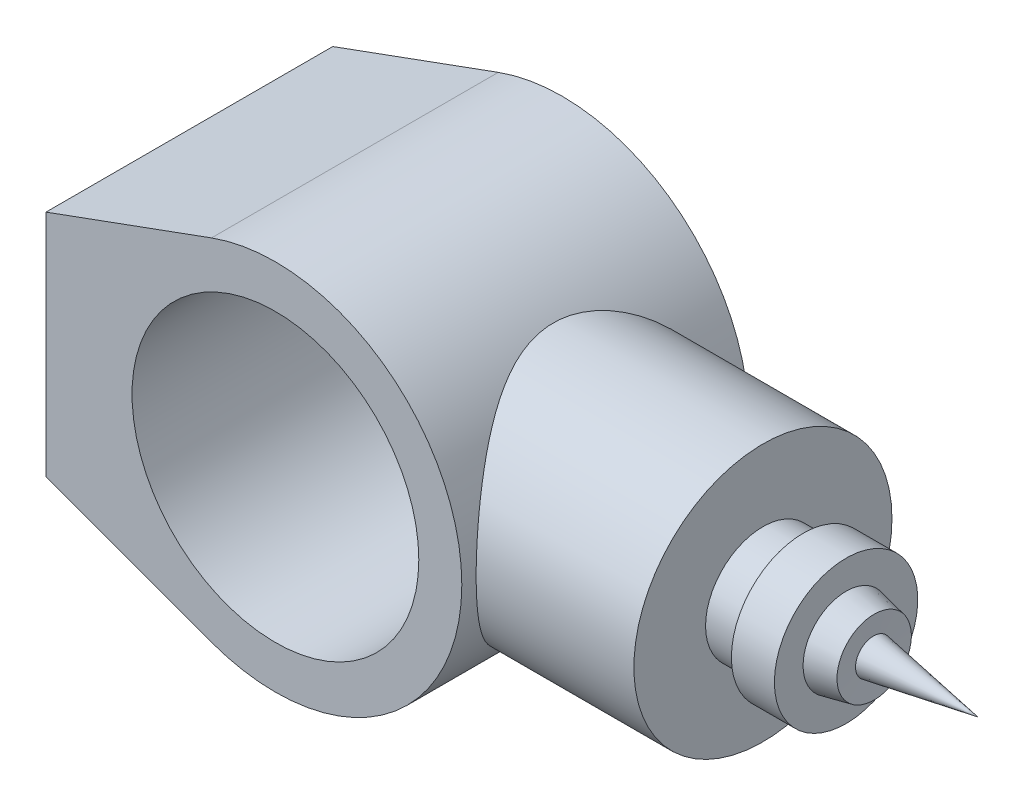
ISO-10303-21;
HEADER;
FILE_DESCRIPTION(('STEP AP214'),'2;1');
FILE_NAME('part.step','',(''),(''),'','','');
FILE_SCHEMA(('AUTOMOTIVE_DESIGN { 1 0 10303 214 1 1 1 1 }'));
ENDSEC;
DATA;
#1=APPLICATION_CONTEXT('core data for automotive mechanical design processes');
#2=APPLICATION_PROTOCOL_DEFINITION('international standard','automotive_design',2000,#1);
#3=PRODUCT_CONTEXT('',#1,'mechanical');
#4=PRODUCT('Part','Part','',(#3));
#5=PRODUCT_RELATED_PRODUCT_CATEGORY('part','',(#4));
#6=PRODUCT_DEFINITION_FORMATION('','',#4);
#7=PRODUCT_DEFINITION_CONTEXT('part definition',#1,'design');
#8=PRODUCT_DEFINITION('design','',#6,#7);
#9=PRODUCT_DEFINITION_SHAPE('','',#8);
#10=(LENGTH_UNIT() NAMED_UNIT(*) SI_UNIT(.MILLI.,.METRE.));
#11=(NAMED_UNIT(*) PLANE_ANGLE_UNIT() SI_UNIT($,.RADIAN.));
#12=(NAMED_UNIT(*) SI_UNIT($,.STERADIAN.) SOLID_ANGLE_UNIT());
#13=UNCERTAINTY_MEASURE_WITH_UNIT(LENGTH_MEASURE(1.E-05),#10,'distance_accuracy_value','');
#14=(GEOMETRIC_REPRESENTATION_CONTEXT(3) GLOBAL_UNCERTAINTY_ASSIGNED_CONTEXT((#13)) GLOBAL_UNIT_ASSIGNED_CONTEXT((#10,
#11,#12)) REPRESENTATION_CONTEXT('',''));
#15=CARTESIAN_POINT('',(0.,0.,0.));
#16=DIRECTION('',(0.,0.,1.));
#17=DIRECTION('',(1.,0.,0.));
#18=AXIS2_PLACEMENT_3D('',#15,#16,#17);
#19=CARTESIAN_POINT('',(0.,0.,50.));
#20=DIRECTION('',(0.,0.,1.));
#21=DIRECTION('',(1.,0.,0.));
#22=AXIS2_PLACEMENT_3D('',#19,#20,#21);
#23=PLANE('',#22);
#24=DIRECTION('',(-0.939410286372225,-0.342794856813887,0.));
#25=VECTOR('',#24,1.);
#26=CARTESIAN_POINT('',(-80.,40.,50.));
#27=LINE('',#26,#25);
#28=CARTESIAN_POINT('',(-22.2816656929027,61.0616686141947,50.));
#29=VERTEX_POINT('',#28);
#30=CARTESIAN_POINT('',(-80.,40.,50.));
#31=VERTEX_POINT('',#30);
#32=EDGE_CURVE('E197',#29,#31,#27,.T.);
#33=ORIENTED_EDGE('',*,*,#32,.T.);
#34=DIRECTION('',(0.,-1.,0.));
#35=VECTOR('',#34,1.);
#36=CARTESIAN_POINT('',(-80.,40.,50.));
#37=LINE('',#36,#35);
#38=CARTESIAN_POINT('',(-80.,-40.,50.));
#39=VERTEX_POINT('',#38);
#40=EDGE_CURVE('E88',#31,#39,#37,.T.);
#41=ORIENTED_EDGE('',*,*,#40,.T.);
#42=DIRECTION('',(0.939410286372225,-0.342794856813887,0.));
#43=VECTOR('',#42,1.);
#44=CARTESIAN_POINT('',(-80.,-40.,50.));
#45=LINE('',#44,#43);
#46=CARTESIAN_POINT('',(-22.2816656929027,-61.0616686141947,50.));
#47=VERTEX_POINT('',#46);
#48=EDGE_CURVE('E190',#39,#47,#45,.T.);
#49=ORIENTED_EDGE('',*,*,#48,.T.);
#50=CARTESIAN_POINT('',(0.,0.,50.));
#51=DIRECTION('',(0.,0.,1.));
#52=DIRECTION('',(1.,0.,0.));
#53=AXIS2_PLACEMENT_3D('',#50,#51,#52);
#54=CIRCLE('',#53,65.);
#55=EDGE_CURVE('E57',#47,#29,#54,.T.);
#56=ORIENTED_EDGE('',*,*,#55,.T.);
#57=EDGE_LOOP('',(#33,#41,#49,#56));
#58=FACE_BOUND('',#57,.T.);
#59=CARTESIAN_POINT('',(0.,0.,50.));
#60=DIRECTION('',(0.,0.,1.));
#61=DIRECTION('',(1.,0.,0.));
#62=AXIS2_PLACEMENT_3D('',#59,#60,#61);
#63=CIRCLE('',#62,50.);
#64=CARTESIAN_POINT('',(50.,0.,50.));
#65=VERTEX_POINT('',#64);
#66=EDGE_CURVE('E212',#65,#65,#63,.T.);
#67=ORIENTED_EDGE('',*,*,#66,.F.);
#68=EDGE_LOOP('',(#67));
#69=FACE_BOUND('',#68,.T.);
#70=ADVANCED_FACE('F39',(#58,#69),#23,.T.);
#71=CARTESIAN_POINT('',(0.,0.,-50.));
#72=DIRECTION('',(0.,0.,1.));
#73=DIRECTION('',(1.,0.,0.));
#74=AXIS2_PLACEMENT_3D('',#71,#72,#73);
#75=PLANE('',#74);
#76=DIRECTION('',(-0.939410286372225,-0.342794856813887,0.));
#77=VECTOR('',#76,1.);
#78=CARTESIAN_POINT('',(-80.,40.,-50.));
#79=LINE('',#78,#77);
#80=CARTESIAN_POINT('',(-22.2816656929027,61.0616686141947,-50.));
#81=VERTEX_POINT('',#80);
#82=CARTESIAN_POINT('',(-80.,40.,-50.));
#83=VERTEX_POINT('',#82);
#84=EDGE_CURVE('E188',#81,#83,#79,.T.);
#85=ORIENTED_EDGE('',*,*,#84,.F.);
#86=CARTESIAN_POINT('',(0.,0.,-50.));
#87=DIRECTION('',(0.,0.,1.));
#88=DIRECTION('',(1.,0.,0.));
#89=AXIS2_PLACEMENT_3D('',#86,#87,#88);
#90=CIRCLE('',#89,65.);
#91=CARTESIAN_POINT('',(-22.2816656929027,-61.0616686141947,-50.));
#92=VERTEX_POINT('',#91);
#93=EDGE_CURVE('E81',#92,#81,#90,.T.);
#94=ORIENTED_EDGE('',*,*,#93,.F.);
#95=DIRECTION('',(0.939410286372225,-0.342794856813887,0.));
#96=VECTOR('',#95,1.);
#97=CARTESIAN_POINT('',(-80.,-40.,-50.));
#98=LINE('',#97,#96);
#99=CARTESIAN_POINT('',(-80.,-40.,-50.));
#100=VERTEX_POINT('',#99);
#101=EDGE_CURVE('E75',#100,#92,#98,.T.);
#102=ORIENTED_EDGE('',*,*,#101,.F.);
#103=DIRECTION('',(0.,-1.,0.));
#104=VECTOR('',#103,1.);
#105=CARTESIAN_POINT('',(-80.,40.,-50.));
#106=LINE('',#105,#104);
#107=EDGE_CURVE('E182',#83,#100,#106,.T.);
#108=ORIENTED_EDGE('',*,*,#107,.F.);
#109=EDGE_LOOP('',(#85,#94,#102,#108));
#110=FACE_BOUND('',#109,.T.);
#111=CARTESIAN_POINT('',(0.,0.,-50.));
#112=DIRECTION('',(0.,0.,1.));
#113=DIRECTION('',(1.,0.,0.));
#114=AXIS2_PLACEMENT_3D('',#111,#112,#113);
#115=CIRCLE('',#114,50.);
#116=CARTESIAN_POINT('',(50.,0.,-50.));
#117=VERTEX_POINT('',#116);
#118=EDGE_CURVE('E215',#117,#117,#115,.T.);
#119=ORIENTED_EDGE('',*,*,#118,.T.);
#120=EDGE_LOOP('',(#119));
#121=FACE_BOUND('',#120,.T.);
#122=ADVANCED_FACE('F162',(#110,#121),#75,.F.);
#123=CARTESIAN_POINT('',(-80.,40.,50.));
#124=DIRECTION('',(0.342794856813887,-0.939410286372225,0.));
#125=DIRECTION('',(0.939410286372225,0.342794856813887,0.));
#126=AXIS2_PLACEMENT_3D('',#123,#124,#125);
#127=PLANE('',#126);
#128=ORIENTED_EDGE('',*,*,#84,.T.);
#129=DIRECTION('',(0.,0.,-1.));
#130=VECTOR('',#129,1.);
#131=CARTESIAN_POINT('',(-80.,40.,50.));
#132=LINE('',#131,#130);
#133=EDGE_CURVE('E11',#31,#83,#132,.T.);
#134=ORIENTED_EDGE('',*,*,#133,.F.);
#135=ORIENTED_EDGE('',*,*,#32,.F.);
#136=DIRECTION('',(0.,0.,-1.));
#137=VECTOR('',#136,1.);
#138=CARTESIAN_POINT('',(-22.2816656929027,61.0616686141947,50.));
#139=LINE('',#138,#137);
#140=EDGE_CURVE('E201',#29,#81,#139,.T.);
#141=ORIENTED_EDGE('',*,*,#140,.T.);
#142=EDGE_LOOP('',(#128,#134,#135,#141));
#143=FACE_BOUND('',#142,.T.);
#144=ADVANCED_FACE('F41',(#143),#127,.F.);
#145=CARTESIAN_POINT('',(-80.,40.,50.));
#146=DIRECTION('',(1.,0.,0.));
#147=DIRECTION('',(0.,1.,0.));
#148=AXIS2_PLACEMENT_3D('',#145,#146,#147);
#149=PLANE('',#148);
#150=ORIENTED_EDGE('',*,*,#107,.T.);
#151=DIRECTION('',(0.,0.,-1.));
#152=VECTOR('',#151,1.);
#153=CARTESIAN_POINT('',(-80.,-40.,50.));
#154=LINE('',#153,#152);
#155=EDGE_CURVE('E49',#39,#100,#154,.T.);
#156=ORIENTED_EDGE('',*,*,#155,.F.);
#157=ORIENTED_EDGE('',*,*,#40,.F.);
#158=ORIENTED_EDGE('',*,*,#133,.T.);
#159=EDGE_LOOP('',(#150,#156,#157,#158));
#160=FACE_BOUND('',#159,.T.);
#161=ADVANCED_FACE('F176',(#160),#149,.F.);
#162=CARTESIAN_POINT('',(-80.,-40.,50.));
#163=DIRECTION('',(0.342794856813887,0.939410286372225,0.));
#164=DIRECTION('',(-0.939410286372225,0.342794856813887,0.));
#165=AXIS2_PLACEMENT_3D('',#162,#163,#164);
#166=PLANE('',#165);
#167=ORIENTED_EDGE('',*,*,#101,.T.);
#168=DIRECTION('',(0.,0.,-1.));
#169=VECTOR('',#168,1.);
#170=CARTESIAN_POINT('',(-22.2816656929027,-61.0616686141947,50.));
#171=LINE('',#170,#169);
#172=EDGE_CURVE('E192',#47,#92,#171,.T.);
#173=ORIENTED_EDGE('',*,*,#172,.F.);
#174=ORIENTED_EDGE('',*,*,#48,.F.);
#175=ORIENTED_EDGE('',*,*,#155,.T.);
#176=EDGE_LOOP('',(#167,#173,#174,#175));
#177=FACE_BOUND('',#176,.T.);
#178=ADVANCED_FACE('F173',(#177),#166,.F.);
#179=CARTESIAN_POINT('',(0.,0.,50.));
#180=DIRECTION('',(0.,0.,-1.));
#181=DIRECTION('',(-1.,0.,0.));
#182=AXIS2_PLACEMENT_3D('',#179,#180,#181);
#183=CYLINDRICAL_SURFACE('',#182,65.);
#184=CARTESIAN_POINT('',(65.,0.,-45.));
#185=CARTESIAN_POINT('',(65.0000011696056,1.12147330120565,-45.0000012025283));
#186=CARTESIAN_POINT('',(64.9709159765212,2.24292945230778,-44.9580201602482));
#187=CARTESIAN_POINT('',(64.8553068641383,4.47658414079083,-44.790785609369));
#188=CARTESIAN_POINT('',(64.7687842573088,5.58878288911932,-44.6655340035371));
#189=CARTESIAN_POINT('',(64.5403785763001,7.79555151848628,-44.3336771879691));
#190=CARTESIAN_POINT('',(64.3984760503456,8.89011506447751,-44.1270433931238));
#191=CARTESIAN_POINT('',(64.0626457436966,11.0533096019768,-43.6354760134034));
#192=CARTESIAN_POINT('',(63.8687169569864,12.1219400915896,-43.3505409144375));
#193=CARTESIAN_POINT('',(63.4342222744662,14.2212125160505,-42.7078017297046));
#194=CARTESIAN_POINT('',(63.1938918545645,15.2520162370063,-42.3503651251477));
#195=CARTESIAN_POINT('',(62.6709259446924,17.2756280115286,-41.5659763086892));
#196=CARTESIAN_POINT('',(62.3882907364915,18.268436318107,-41.1390245597888));
#197=CARTESIAN_POINT('',(61.786108553932,20.2116697228795,-40.2199419970838));
#198=CARTESIAN_POINT('',(61.4665619062631,21.1620951960855,-39.7278117601444));
#199=CARTESIAN_POINT('',(60.7962171584065,23.0172309124315,-38.6825647509799));
#200=CARTESIAN_POINT('',(60.4454175300334,23.9219389167185,-38.1294449962195));
#201=CARTESIAN_POINT('',(59.6865648974474,25.7601880140228,-36.9151737617935));
#202=CARTESIAN_POINT('',(59.27618815402,26.6893215363404,-36.2488040005491));
#203=CARTESIAN_POINT('',(58.4330275057249,28.4880338622967,-34.8529502059224));
#204=CARTESIAN_POINT('',(58.0002425478181,29.3576098626539,-34.1234632053608));
#205=CARTESIAN_POINT('',(57.1195111836477,31.0364486388513,-32.6040251352403));
#206=CARTESIAN_POINT('',(56.6715447181891,31.8456267033451,-31.8139921794123));
#207=CARTESIAN_POINT('',(55.7691986061138,33.4006700551814,-30.1773036556993));
#208=CARTESIAN_POINT('',(55.3148185876119,34.1465316534289,-29.3306447936721));
#209=CARTESIAN_POINT('',(54.3303114345595,35.6959084068904,-27.4326466159467));
#210=CARTESIAN_POINT('',(53.8005937511269,36.4872853280241,-26.3711450656526));
#211=CARTESIAN_POINT('',(52.7593327891933,37.9773509509911,-24.17604025639));
#212=CARTESIAN_POINT('',(52.2477941160227,38.6760162868262,-23.0424189272517));
#213=CARTESIAN_POINT('',(51.2608149265043,39.9749077721744,-20.7072341856928));
#214=CARTESIAN_POINT('',(50.7853275075273,40.5752630453964,-19.5057627267966));
#215=CARTESIAN_POINT('',(49.8892399163793,41.6721166930025,-17.036931864064));
#216=CARTESIAN_POINT('',(49.4686114171659,42.1686687478853,-15.7696069409943));
#217=CARTESIAN_POINT('',(48.8208029416879,42.9149535309565,-13.5723996352816));
#218=CARTESIAN_POINT('',(48.5738420263557,43.1936925213245,-12.6581208440976));
#219=CARTESIAN_POINT('',(48.1238801744123,43.6944569649788,-10.803538922355));
#220=CARTESIAN_POINT('',(47.9208721021929,43.9164916250901,-9.86324004407418));
#221=CARTESIAN_POINT('',(47.5660754926548,44.3005296261305,-7.96250438663408));
#222=CARTESIAN_POINT('',(47.4142038087044,44.4626304606427,-7.00210302149486));
#223=CARTESIAN_POINT('',(47.1671263845177,44.7246555122386,-5.06554052628516));
#224=CARTESIAN_POINT('',(47.0719206259529,44.824579749433,-4.08937940131223));
#225=CARTESIAN_POINT('',(46.9418899090943,44.9607388198673,-2.1232364847967));
#226=CARTESIAN_POINT('',(46.9073939345417,44.9966266570423,-1.13320851844658));
#227=CARTESIAN_POINT('',(46.9013571135476,45.0029190462422,0.847248377093849));
#228=CARTESIAN_POINT('',(46.9298161498631,44.9733237202183,1.837677305534));
#229=CARTESIAN_POINT('',(47.0484302849821,44.8492190899201,3.81128752429081));
#230=CARTESIAN_POINT('',(47.13862305521,44.7546701492421,4.79446401850661));
#231=CARTESIAN_POINT('',(47.3768313176079,44.5024241630868,6.74551496467455));
#232=CARTESIAN_POINT('',(47.5248480621437,44.3447257499009,7.71338908473168));
#233=CARTESIAN_POINT('',(47.862176427184,43.9803320764262,9.56919366964684));
#234=CARTESIAN_POINT('',(48.0484149088864,43.7772163066585,10.4583970625519));
#235=CARTESIAN_POINT('',(48.4609441046406,43.32010640119,12.2144143492181));
#236=CARTESIAN_POINT('',(48.6872496045115,43.0660934784815,13.0812198417583));
#237=CARTESIAN_POINT('',(49.1738509640383,42.5096331932465,14.7898225666927));
#238=CARTESIAN_POINT('',(49.4341648638834,42.2071601049958,15.6316062329481));
#239=CARTESIAN_POINT('',(49.9825182796335,41.5563350032134,17.2876417419013));
#240=CARTESIAN_POINT('',(50.2705534011697,41.2079902580444,18.1018979206949));
#241=CARTESIAN_POINT('',(51.0225431471344,40.2767822129268,20.1137766396802));
#242=CARTESIAN_POINT('',(51.5007434523328,39.6654891440572,21.2930273345177));
#243=CARTESIAN_POINT('',(52.4891158781477,38.348029920852,23.5833678403921));
#244=CARTESIAN_POINT('',(52.9993005340588,37.6418264436727,24.6944305853524));
#245=CARTESIAN_POINT('',(54.0361557973494,36.1376496350166,26.8476775780095));
#246=CARTESIAN_POINT('',(54.5628535785461,35.3395185623559,27.8897384505711));
#247=CARTESIAN_POINT('',(55.6171804467178,33.6558443419671,29.8998791095632));
#248=CARTESIAN_POINT('',(56.1448094104418,32.7703120184234,30.8679680307498));
#249=CARTESIAN_POINT('',(57.1932449701135,30.9045304086319,32.7363921475659));
#250=CARTESIAN_POINT('',(57.7139191350983,29.9233731295192,33.6358963165067));
#251=CARTESIAN_POINT('',(58.7296419536465,27.8771206485979,35.350355349792));
#252=CARTESIAN_POINT('',(59.2246882700661,26.8120178135979,36.1653025097018));
#253=CARTESIAN_POINT('',(60.1756566955639,24.6035209522421,37.7024332048813));
#254=CARTESIAN_POINT('',(60.6316475651595,23.4602711709794,38.4247809320632));
#255=CARTESIAN_POINT('',(61.4931891608211,21.0989507187335,39.7703323765769));
#256=CARTESIAN_POINT('',(61.898755017873,19.8809026570889,40.3935658507715));
#257=CARTESIAN_POINT('',(62.5646802947783,17.6549035875763,41.4059204565395));
#258=CARTESIAN_POINT('',(62.8372982548467,16.6602403417734,41.8163120535009));
#259=CARTESIAN_POINT('',(63.3397164077328,14.6345031625144,42.5675669112335));
#260=CARTESIAN_POINT('',(63.569522535998,13.603434299959,42.9084398107234));
#261=CARTESIAN_POINT('',(63.9815049902596,11.5110112910016,43.5164676119118));
#262=CARTESIAN_POINT('',(64.1637052650743,10.4496726714621,43.7836595836378));
#263=CARTESIAN_POINT('',(64.476639865795,8.30296993183372,44.2409869387356));
#264=CARTESIAN_POINT('',(64.6073730982257,7.21760530180254,44.431120684921));
#265=CARTESIAN_POINT('',(64.8147345736682,5.02649787175022,44.7321113931983));
#266=CARTESIAN_POINT('',(64.8911534961694,3.92069290489762,44.8426616714377));
#267=CARTESIAN_POINT('',(64.9872183357685,1.70145350776207,44.981563734156));
#268=CARTESIAN_POINT('',(65.0068642771874,0.58801908074768,45.0099155538474));
#269=CARTESIAN_POINT('',(64.9889001241945,-1.63741781931567,44.9839662509349));
#270=CARTESIAN_POINT('',(64.9512898349751,-2.74942028747967,44.929664847113));
#271=CARTESIAN_POINT('',(64.819734418053,-4.96298947367603,44.7392747901952));
#272=CARTESIAN_POINT('',(64.7257910494465,-6.06455651648128,44.6031886909653));
#273=CARTESIAN_POINT('',(64.491175703309,-8.18254449212149,44.2620157992034));
#274=CARTESIAN_POINT('',(64.3536808680178,-9.20007959997774,44.0616107864454));
#275=CARTESIAN_POINT('',(64.0337856060908,-11.2121337136589,43.5930613516679));
#276=CARTESIAN_POINT('',(63.8513873855499,-12.2066538475799,43.3249202574929));
#277=CARTESIAN_POINT('',(63.4451725249075,-14.1673074608523,42.7239854011605));
#278=CARTESIAN_POINT('',(63.2213525684632,-15.1334386601223,42.3911864622047));
#279=CARTESIAN_POINT('',(62.736336352677,-17.0327019487273,41.6643868113868));
#280=CARTESIAN_POINT('',(62.4751380044848,-17.965832190203,41.2703826790343));
#281=CARTESIAN_POINT('',(61.8990085085122,-19.8637431772395,40.3931275129008));
#282=CARTESIAN_POINT('',(61.58152095285,-20.8256806929253,39.9054081529014));
#283=CARTESIAN_POINT('',(60.9142086391395,-22.7035764997345,38.8677076181211));
#284=CARTESIAN_POINT('',(60.5643826081083,-23.6195329786528,38.3177239921568));
#285=CARTESIAN_POINT('',(59.8381347129401,-25.4032558353403,37.1592008079418));
#286=CARTESIAN_POINT('',(59.4616987975441,-26.270996314329,36.5506302507532));
#287=CARTESIAN_POINT('',(58.6884577670336,-27.9557544991496,35.2787474176624));
#288=CARTESIAN_POINT('',(58.2916515549571,-28.7727694681138,34.6154321925309));
#289=CARTESIAN_POINT('',(57.4151711853793,-30.4889708749912,33.1199200847161));
#290=CARTESIAN_POINT('',(56.9328754552547,-31.3785212006928,32.2781812569548));
#291=CARTESIAN_POINT('',(55.9590893109094,-33.083904221517,30.5278352445589));
#292=CARTESIAN_POINT('',(55.4675975421249,-33.8997259516808,29.6192181500899));
#293=CARTESIAN_POINT('',(54.4860350387396,-35.45586994741,27.7375714933992));
#294=CARTESIAN_POINT('',(53.9959654596117,-36.1961418986444,26.7644997080006));
#295=CARTESIAN_POINT('',(53.0294834997435,-37.5978502361012,24.7568233036381));
#296=CARTESIAN_POINT('',(52.553069328415,-38.2592969946585,23.7222268074148));
#297=CARTESIAN_POINT('',(51.679941347726,-39.4291013564639,21.7149007388746));
#298=CARTESIAN_POINT('',(51.2803372484816,-39.9463152685163,20.7485884228094));
#299=CARTESIAN_POINT('',(50.5123974548912,-40.913063666173,18.7705314851885));
#300=CARTESIAN_POINT('',(50.1440619804653,-41.3625976757848,17.7587865441704));
#301=CARTESIAN_POINT('',(49.4504928922364,-42.1893301292689,15.693797265063));
#302=CARTESIAN_POINT('',(49.1251906412472,-42.566644202947,14.6406225749502));
#303=CARTESIAN_POINT('',(48.5290098021012,-43.2451098617227,12.4950157035289));
#304=CARTESIAN_POINT('',(48.2581179989952,-43.5462799449171,11.4025931307277));
#305=CARTESIAN_POINT('',(47.8271610412375,-44.0186874861181,9.39216299943509));
#306=CARTESIAN_POINT('',(47.6558419905218,-44.2036946073207,8.47979353570418));
#307=CARTESIAN_POINT('',(47.3627606953031,-44.517583244497,6.63757582668244));
#308=CARTESIAN_POINT('',(47.2409923142224,-44.6464717105955,5.70772976070373));
#309=CARTESIAN_POINT('',(47.05166615705,-44.8459556683364,3.83718735816971));
#310=CARTESIAN_POINT('',(46.9840561376509,-44.9166073394187,2.89650236820514));
#311=CARTESIAN_POINT('',(46.9055698265682,-44.9985645522097,1.01014116515035));
#312=CARTESIAN_POINT('',(46.8946943314281,-45.0098692606967,0.0644648821697862));
#313=CARTESIAN_POINT('',(46.9301408777119,-44.972908524549,-1.82506201386804));
#314=CARTESIAN_POINT('',(46.9764888551696,-44.9246160680299,-2.76891160474201));
#315=CARTESIAN_POINT('',(47.1245232303033,-44.7693052695385,-4.64731891289862));
#316=CARTESIAN_POINT('',(47.226209296244,-44.6622872796082,-5.58187668584875));
#317=CARTESIAN_POINT('',(47.4811423262629,-44.3911660407895,-7.43666598606561));
#318=CARTESIAN_POINT('',(47.634452919394,-44.2269923369625,-8.35687836049678));
#319=CARTESIAN_POINT('',(47.9871889035597,-43.8440109221367,-10.1768310643423));
#320=CARTESIAN_POINT('',(48.1866204648689,-43.6251959006593,-11.0765686368372));
#321=CARTESIAN_POINT('',(48.6908782922366,-43.0625185245671,-13.116726178063));
#322=CARTESIAN_POINT('',(49.0093972350599,-42.7008255731353,-14.2488681052183));
#323=CARTESIAN_POINT('',(49.699554494161,-41.8955268796886,-16.4668795226373));
#324=CARTESIAN_POINT('',(50.0712093704162,-41.4518955887103,-17.5527344499461));
#325=CARTESIAN_POINT('',(50.8544123719762,-40.4872212981013,-19.6760329984318));
#326=CARTESIAN_POINT('',(51.2660067549033,-39.9660881554129,-20.7134183727638));
#327=CARTESIAN_POINT('',(52.116211879306,-38.8508952329155,-22.7363587217865));
#328=CARTESIAN_POINT('',(52.5548209260535,-38.2568400254561,-23.7219169406072));
#329=CARTESIAN_POINT('',(53.4579357785502,-36.9847423381263,-25.6613286822633));
#330=CARTESIAN_POINT('',(53.9228021101371,-36.3051118639051,-26.6139712103077));
#331=CARTESIAN_POINT('',(54.8583333343946,-34.8753950985048,-28.4617532840731));
#332=CARTESIAN_POINT('',(55.3289982185488,-34.1253089107936,-29.3568929142368));
#333=CARTESIAN_POINT('',(56.2664339133502,-32.5564691651912,-31.0876310121466));
#334=CARTESIAN_POINT('',(56.7332035093429,-31.7376950080829,-31.923211478402));
#335=CARTESIAN_POINT('',(57.6535165855435,-30.033481652025,-33.5315189390535));
#336=CARTESIAN_POINT('',(58.1070588196761,-29.1480362003111,-34.3042400240121));
#337=CARTESIAN_POINT('',(59.0635284336244,-27.1643113596245,-35.9022819462667));
#338=CARTESIAN_POINT('',(59.5626106290919,-26.0547472869609,-36.7159606163357));
#339=CARTESIAN_POINT('',(60.5176757229357,-23.7521280348397,-38.2458641369291));
#340=CARTESIAN_POINT('',(60.9736519283074,-22.5590599397197,-38.962073861155));
#341=CARTESIAN_POINT('',(61.6149926579414,-20.7127348127311,-39.9558623322098));
#342=CARTESIAN_POINT('',(61.8215919655178,-20.088110583999,-40.2735888165198));
#343=CARTESIAN_POINT('',(62.2191547005856,-18.8206694867556,-40.8812436548858));
#344=CARTESIAN_POINT('',(62.4101203779565,-18.1778552539997,-41.1711760099034));
#345=CARTESIAN_POINT('',(62.7748527233683,-16.875283117665,-41.7219931318356));
#346=CARTESIAN_POINT('',(62.9486230408552,-16.2155288469421,-41.9828840638124));
#347=CARTESIAN_POINT('',(63.2775356475736,-14.8804011558234,-42.4744610119283));
#348=CARTESIAN_POINT('',(63.432679284421,-14.2050288695918,-42.7051492133045));
#349=CARTESIAN_POINT('',(63.8070721968101,-12.4447010544915,-43.25974494481));
#350=CARTESIAN_POINT('',(64.0114184468014,-11.3490405228655,-43.5602757498286));
#351=CARTESIAN_POINT('',(64.3654191982087,-9.12991345978807,-44.0788276443961));
#352=CARTESIAN_POINT('',(64.5150820049425,-8.0064511785626,-44.2968612637911));
#353=CARTESIAN_POINT('',(64.7559993187061,-5.74082253729113,-44.6470112993716));
#354=CARTESIAN_POINT('',(64.847297757104,-4.59867091062173,-44.7791923387443));
#355=CARTESIAN_POINT('',(64.9692976296881,-2.30434018473195,-44.9556862638234));
#356=CARTESIAN_POINT('',(64.9999987983895,-1.15216104160189,-44.999998764566));
#357=CARTESIAN_POINT('',(65.,0.,-45.));
#358=B_SPLINE_CURVE_WITH_KNOTS('',3,(#184,#185,#186,#187,#188,#189,#190,#191,#192,#193,#194,
#195,#196,#197,#198,#199,#200,#201,#202,#203,#204,#205,#206,#207,#208,#209,#210,#211,#212,#213,
#214,#215,#216,#217,#218,#219,#220,#221,#222,#223,#224,#225,#226,#227,#228,#229,#230,#231,#232,
#233,#234,#235,#236,#237,#238,#239,#240,#241,#242,#243,#244,#245,#246,#247,#248,#249,#250,#251,
#252,#253,#254,#255,#256,#257,#258,#259,#260,#261,#262,#263,#264,#265,#266,#267,#268,#269,#270,
#271,#272,#273,#274,#275,#276,#277,#278,#279,#280,#281,#282,#283,#284,#285,#286,#287,#288,#289,
#290,#291,#292,#293,#294,#295,#296,#297,#298,#299,#300,#301,#302,#303,#304,#305,#306,#307,#308,
#309,#310,#311,#312,#313,#314,#315,#316,#317,#318,#319,#320,#321,#322,#323,#324,#325,#326,#327,
#328,#329,#330,#331,#332,#333,#334,#335,#336,#337,#338,#339,#340,#341,#342,#343,#344,#345,#346,
#347,#348,#349,#350,#351,#352,#353,#354,#355,#356,#357),.UNSPECIFIED.,.T.,.F.,(4,2,2,2,2,2,2,2,
2,2,2,2,2,2,2,2,2,2,2,2,2,2,2,2,2,2,2,2,2,2,2,2,2,2,2,2,2,2,2,2,2,2,2,2,2,2,2,2,2,2,2,2,2,2,2,2,
2,2,2,2,2,2,2,2,2,2,2,2,2,2,2,2,2,2,2,2,2,2,2,2,2,2,2,2,2,2,4),(0.,3.36323892794144,
6.72640100710137,10.0907454360665,13.4551549250109,16.8029195613731,20.1506619010729,
23.4983746134034,26.8462511096753,30.4871649037347,34.1282499524345,37.7743494260164,
41.4206611917409,45.6939383064405,49.9682903731881,54.2369825353393,58.5034617073672,
61.4625138492406,64.4210852373372,67.3748225577202,70.3285589227264,73.2982527376573,
76.2679410220408,79.2394430998938,82.2110095388412,85.0011411726389,87.7923045951578,
90.584954683776,93.3771628083065,97.6064034875675,101.837312178738,106.075592113262,
110.313347816192,114.596218662803,118.879479402292,123.155037051935,127.429308626693,
130.755998382163,134.082226580387,137.406778235214,140.731400520075,144.068767009318,
147.406132068879,150.743508483461,154.080780688208,157.215791533369,160.350648386749,
163.485756334407,166.621039552604,169.990545063149,173.360183268584,176.73161428665,
180.103227050672,184.047902440152,187.993163521895,191.94103513809,195.888386692538,
199.385185586645,202.88200907258,206.373186157811,209.863514294626,212.700365177753,
215.536864625513,218.370624567028,221.204424293963,224.039508887241,226.874576485218,
229.713151272815,232.55210603787,236.23803941247,239.925124033801,243.616531168718,
247.307706963636,251.081871120678,254.856029735252,258.631324277359,262.406973327354,
266.792058434818,271.177823293658,273.368885604935,275.55963203795,277.749912517597,
279.940034437727,283.398420446896,286.856280978073,290.31153567335,293.766805506531),.UNSPECIFIED.);
#359=CARTESIAN_POINT('',(65.,0.,-45.));
#360=VERTEX_POINT('',#359);
#361=EDGE_CURVE('E127',#360,#360,#358,.T.);
#362=ORIENTED_EDGE('',*,*,#361,.F.);
#363=EDGE_LOOP('',(#362));
#364=FACE_BOUND('',#363,.T.);
#365=ORIENTED_EDGE('',*,*,#93,.T.);
#366=ORIENTED_EDGE('',*,*,#140,.F.);
#367=ORIENTED_EDGE('',*,*,#55,.F.);
#368=ORIENTED_EDGE('',*,*,#172,.T.);
#369=EDGE_LOOP('',(#365,#366,#367,#368));
#370=FACE_BOUND('',#369,.T.);
#371=ADVANCED_FACE('F159',(#364,#370),#183,.T.);
#372=CARTESIAN_POINT('',(0.,0.,50.));
#373=DIRECTION('',(0.,0.,-1.));
#374=DIRECTION('',(-1.,0.,0.));
#375=AXIS2_PLACEMENT_3D('',#372,#373,#374);
#376=CYLINDRICAL_SURFACE('',#375,50.);
#377=ORIENTED_EDGE('',*,*,#66,.T.);
#378=EDGE_LOOP('',(#377));
#379=FACE_BOUND('',#378,.T.);
#380=ORIENTED_EDGE('',*,*,#118,.F.);
#381=EDGE_LOOP('',(#380));
#382=FACE_BOUND('',#381,.T.);
#383=ADVANCED_FACE('F149',(#379,#382),#376,.F.);
#384=CARTESIAN_POINT('',(-80.002,0.,0.));
#385=DIRECTION('',(1.,0.,0.));
#386=DIRECTION('',(0.,0.,-1.));
#387=AXIS2_PLACEMENT_3D('',#384,#385,#386);
#388=CYLINDRICAL_SURFACE('',#387,45.);
#389=CARTESIAN_POINT('',(120.,0.,0.));
#390=DIRECTION('',(1.,0.,0.));
#391=DIRECTION('',(0.,0.,-1.));
#392=AXIS2_PLACEMENT_3D('',#389,#390,#391);
#393=CIRCLE('',#392,45.);
#394=CARTESIAN_POINT('',(120.,0.,-45.));
#395=VERTEX_POINT('',#394);
#396=EDGE_CURVE('E136',#395,#395,#393,.T.);
#397=ORIENTED_EDGE('',*,*,#396,.F.);
#398=EDGE_LOOP('',(#397));
#399=FACE_BOUND('',#398,.T.);
#400=ORIENTED_EDGE('',*,*,#361,.T.);
#401=EDGE_LOOP('',(#400));
#402=FACE_BOUND('',#401,.T.);
#403=ADVANCED_FACE('F138',(#399,#402),#388,.T.);
#404=CARTESIAN_POINT('',(120.,0.,0.));
#405=DIRECTION('',(1.,0.,0.));
#406=DIRECTION('',(0.,0.,-1.));
#407=AXIS2_PLACEMENT_3D('',#404,#405,#406);
#408=PLANE('',#407);
#409=CARTESIAN_POINT('',(120.,0.,0.));
#410=DIRECTION('',(-1.,0.,0.));
#411=DIRECTION('',(0.,0.,1.));
#412=AXIS2_PLACEMENT_3D('',#409,#410,#411);
#413=CIRCLE('',#412,20.);
#414=CARTESIAN_POINT('',(120.,0.,20.));
#415=VERTEX_POINT('',#414);
#416=EDGE_CURVE('E104',#415,#415,#413,.T.);
#417=ORIENTED_EDGE('',*,*,#416,.T.);
#418=EDGE_LOOP('',(#417));
#419=FACE_BOUND('',#418,.T.);
#420=ORIENTED_EDGE('',*,*,#396,.T.);
#421=EDGE_LOOP('',(#420));
#422=FACE_BOUND('',#421,.T.);
#423=ADVANCED_FACE('F146',(#419,#422),#408,.T.);
#424=CARTESIAN_POINT('',(134.,-20.,0.));
#425=DIRECTION('',(-1.,0.,0.));
#426=DIRECTION('',(0.,0.,1.));
#427=AXIS2_PLACEMENT_3D('',#424,#425,#426);
#428=PLANE('',#427);
#429=CARTESIAN_POINT('',(134.,0.,0.));
#430=DIRECTION('',(-1.,0.,0.));
#431=DIRECTION('',(0.,0.,1.));
#432=AXIS2_PLACEMENT_3D('',#429,#430,#431);
#433=CIRCLE('',#432,25.);
#434=CARTESIAN_POINT('',(134.,0.,25.));
#435=VERTEX_POINT('',#434);
#436=EDGE_CURVE('E123',#435,#435,#433,.T.);
#437=ORIENTED_EDGE('',*,*,#436,.T.);
#438=EDGE_LOOP('',(#437));
#439=FACE_BOUND('',#438,.T.);
#440=CARTESIAN_POINT('',(134.,0.,0.));
#441=DIRECTION('',(-1.,0.,0.));
#442=DIRECTION('',(0.,0.,1.));
#443=AXIS2_PLACEMENT_3D('',#440,#441,#442);
#444=CIRCLE('',#443,20.);
#445=CARTESIAN_POINT('',(134.,0.,20.));
#446=VERTEX_POINT('',#445);
#447=EDGE_CURVE('E112',#446,#446,#444,.T.);
#448=ORIENTED_EDGE('',*,*,#447,.F.);
#449=EDGE_LOOP('',(#448));
#450=FACE_BOUND('',#449,.T.);
#451=ADVANCED_FACE('F144',(#439,#450),#428,.T.);
#452=CARTESIAN_POINT('',(120.,0.,0.));
#453=DIRECTION('',(-1.,0.,0.));
#454=DIRECTION('',(0.,0.,1.));
#455=AXIS2_PLACEMENT_3D('',#452,#453,#454);
#456=CYLINDRICAL_SURFACE('',#455,25.);
#457=CARTESIAN_POINT('',(149.,0.,0.));
#458=DIRECTION('',(-1.,0.,0.));
#459=DIRECTION('',(0.,0.,1.));
#460=AXIS2_PLACEMENT_3D('',#457,#458,#459);
#461=CIRCLE('',#460,25.);
#462=CARTESIAN_POINT('',(149.,0.,25.));
#463=VERTEX_POINT('',#462);
#464=EDGE_CURVE('E119',#463,#463,#461,.T.);
#465=ORIENTED_EDGE('',*,*,#464,.T.);
#466=EDGE_LOOP('',(#465));
#467=FACE_BOUND('',#466,.T.);
#468=ORIENTED_EDGE('',*,*,#436,.F.);
#469=EDGE_LOOP('',(#468));
#470=FACE_BOUND('',#469,.T.);
#471=ADVANCED_FACE('F154',(#467,#470),#456,.T.);
#472=CARTESIAN_POINT('',(149.,-25.,0.));
#473=DIRECTION('',(1.,0.,0.));
#474=DIRECTION('',(0.,0.,-1.));
#475=AXIS2_PLACEMENT_3D('',#472,#473,#474);
#476=PLANE('',#475);
#477=CARTESIAN_POINT('',(149.,0.,0.));
#478=DIRECTION('',(-1.,0.,0.));
#479=DIRECTION('',(0.,0.,1.));
#480=AXIS2_PLACEMENT_3D('',#477,#478,#479);
#481=CIRCLE('',#480,15.);
#482=CARTESIAN_POINT('',(149.,0.,15.));
#483=VERTEX_POINT('',#482);
#484=EDGE_CURVE('E109',#483,#483,#481,.T.);
#485=ORIENTED_EDGE('',*,*,#484,.T.);
#486=EDGE_LOOP('',(#485));
#487=FACE_BOUND('',#486,.T.);
#488=ORIENTED_EDGE('',*,*,#464,.F.);
#489=EDGE_LOOP('',(#488));
#490=FACE_BOUND('',#489,.T.);
#491=ADVANCED_FACE('F285',(#487,#490),#476,.T.);
#492=CARTESIAN_POINT('',(149.,0.,0.));
#493=DIRECTION('',(-1.,0.,0.));
#494=DIRECTION('',(0.,0.,1.));
#495=AXIS2_PLACEMENT_3D('',#492,#493,#494);
#496=CONICAL_SURFACE('',#495,15.,0.205332698505687);
#497=CARTESIAN_POINT('',(158.789932038456,0.,0.));
#498=DIRECTION('',(-1.,0.,0.));
#499=DIRECTION('',(0.,0.,1.));
#500=AXIS2_PLACEMENT_3D('',#497,#498,#499);
#501=CIRCLE('',#500,12.9610711924096);
#502=CARTESIAN_POINT('',(158.789932038456,0.,12.9610711924096));
#503=VERTEX_POINT('',#502);
#504=EDGE_CURVE('E103',#503,#503,#501,.T.);
#505=ORIENTED_EDGE('',*,*,#504,.T.);
#506=EDGE_LOOP('',(#505));
#507=FACE_BOUND('',#506,.T.);
#508=ORIENTED_EDGE('',*,*,#484,.F.);
#509=EDGE_LOOP('',(#508));
#510=FACE_BOUND('',#509,.T.);
#511=ADVANCED_FACE('F293',(#507,#510),#496,.T.);
#512=CARTESIAN_POINT('',(158.789932038456,0.,0.));
#513=DIRECTION('',(1.,0.,0.));
#514=DIRECTION('',(0.,0.,-1.));
#515=AXIS2_PLACEMENT_3D('',#512,#513,#514);
#516=CONICAL_SURFACE('',#515,12.9610711924096,1.53212919996899);
#517=CARTESIAN_POINT('',(158.529899955497,0.,0.));
#518=DIRECTION('',(-1.,0.,0.));
#519=DIRECTION('',(0.,0.,1.));
#520=AXIS2_PLACEMENT_3D('',#517,#518,#519);
#521=CIRCLE('',#520,6.2395354589853);
#522=CARTESIAN_POINT('',(158.529899955497,0.,6.2395354589853));
#523=VERTEX_POINT('',#522);
#524=EDGE_CURVE('E100',#523,#523,#521,.T.);
#525=ORIENTED_EDGE('',*,*,#524,.T.);
#526=EDGE_LOOP('',(#525));
#527=FACE_BOUND('',#526,.T.);
#528=ORIENTED_EDGE('',*,*,#504,.F.);
#529=EDGE_LOOP('',(#528));
#530=FACE_BOUND('',#529,.T.);
#531=ADVANCED_FACE('F96',(#527,#530),#516,.F.);
#532=CARTESIAN_POINT('',(158.529899955497,0.,0.));
#533=DIRECTION('',(-1.,0.,0.));
#534=DIRECTION('',(0.,0.,1.));
#535=AXIS2_PLACEMENT_3D('',#532,#533,#534);
#536=CONICAL_SURFACE('',#535,6.2395354589853,0.169445781180562);
#537=CARTESIAN_POINT('',(195.,0.,0.));
#538=VERTEX_POINT('',#537);
#539=VERTEX_LOOP('',#538);
#540=FACE_BOUND('',#539,.T.);
#541=ORIENTED_EDGE('',*,*,#524,.F.);
#542=EDGE_LOOP('',(#541));
#543=FACE_BOUND('',#542,.T.);
#544=ADVANCED_FACE('F92',(#540,#543),#536,.T.);
#545=CARTESIAN_POINT('',(120.,0.,0.));
#546=DIRECTION('',(-1.,0.,0.));
#547=DIRECTION('',(0.,0.,1.));
#548=AXIS2_PLACEMENT_3D('',#545,#546,#547);
#549=CYLINDRICAL_SURFACE('',#548,20.);
#550=ORIENTED_EDGE('',*,*,#447,.T.);
#551=EDGE_LOOP('',(#550));
#552=FACE_BOUND('',#551,.T.);
#553=ORIENTED_EDGE('',*,*,#416,.F.);
#554=EDGE_LOOP('',(#553));
#555=FACE_BOUND('',#554,.T.);
#556=ADVANCED_FACE('F95',(#552,#555),#549,.T.);
#557=CLOSED_SHELL('',(#70,#122,#144,#161,#178,#371,#383,#403,#423,#451,#471,#491,#511,#531,#544,#556));
#558=MANIFOLD_SOLID_BREP('B2',#557);
#559=ADVANCED_BREP_SHAPE_REPRESENTATION('',(#18,#558),#14);
#560=SHAPE_DEFINITION_REPRESENTATION(#9,#559);
ENDSEC;
END-ISO-10303-21;
